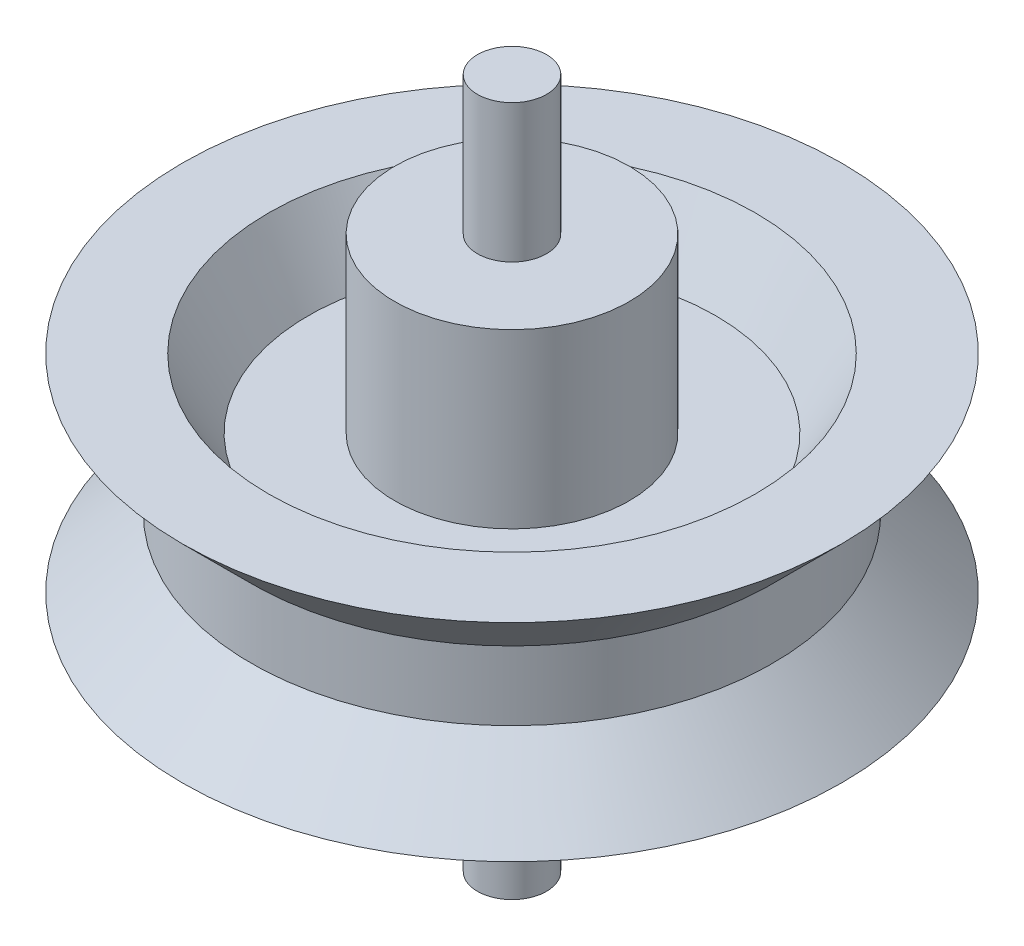
ISO-10303-21;
HEADER;
FILE_DESCRIPTION(('STEP AP214'),'2;1');
FILE_NAME('part.step','',(''),(''),'','','');
FILE_SCHEMA(('AUTOMOTIVE_DESIGN { 1 0 10303 214 1 1 1 1 }'));
ENDSEC;
DATA;
#1=APPLICATION_CONTEXT('core data for automotive mechanical design processes');
#2=APPLICATION_PROTOCOL_DEFINITION('international standard','automotive_design',2000,#1);
#3=PRODUCT_CONTEXT('',#1,'mechanical');
#4=PRODUCT('Part','Part','',(#3));
#5=PRODUCT_RELATED_PRODUCT_CATEGORY('part','',(#4));
#6=PRODUCT_DEFINITION_FORMATION('','',#4);
#7=PRODUCT_DEFINITION_CONTEXT('part definition',#1,'design');
#8=PRODUCT_DEFINITION('design','',#6,#7);
#9=PRODUCT_DEFINITION_SHAPE('','',#8);
#10=(LENGTH_UNIT() NAMED_UNIT(*) SI_UNIT(.MILLI.,.METRE.));
#11=(NAMED_UNIT(*) PLANE_ANGLE_UNIT() SI_UNIT($,.RADIAN.));
#12=(NAMED_UNIT(*) SI_UNIT($,.STERADIAN.) SOLID_ANGLE_UNIT());
#13=UNCERTAINTY_MEASURE_WITH_UNIT(LENGTH_MEASURE(1.E-05),#10,'distance_accuracy_value','');
#14=(GEOMETRIC_REPRESENTATION_CONTEXT(3) GLOBAL_UNCERTAINTY_ASSIGNED_CONTEXT((#13)) GLOBAL_UNIT_ASSIGNED_CONTEXT((#10,
#11,#12)) REPRESENTATION_CONTEXT('',''));
#15=CARTESIAN_POINT('',(0.,0.,0.));
#16=DIRECTION('',(0.,0.,1.));
#17=DIRECTION('',(1.,0.,0.));
#18=AXIS2_PLACEMENT_3D('',#15,#16,#17);
#19=CARTESIAN_POINT('',(0.,-4.99999999999997,-1.));
#20=DIRECTION('',(0.,-1.,0.));
#21=DIRECTION('',(0.,0.,-1.));
#22=AXIS2_PLACEMENT_3D('',#19,#20,#21);
#23=PLANE('',#22);
#24=CARTESIAN_POINT('',(0.,-4.99999999999997,0.));
#25=DIRECTION('',(0.,-1.,0.));
#26=DIRECTION('',(0.,0.,-1.));
#27=AXIS2_PLACEMENT_3D('',#24,#25,#26);
#28=CIRCLE('',#27,3.4);
#29=CARTESIAN_POINT('',(0.,-4.99999999999997,-3.4));
#30=VERTEX_POINT('',#29);
#31=EDGE_CURVE('E10',#30,#30,#28,.T.);
#32=ORIENTED_EDGE('',*,*,#31,.T.);
#33=EDGE_LOOP('',(#32));
#34=FACE_BOUND('',#33,.T.);
#35=CARTESIAN_POINT('',(0.,-4.99999999999997,0.));
#36=DIRECTION('',(0.,-1.,0.));
#37=DIRECTION('',(0.,0.,-1.));
#38=AXIS2_PLACEMENT_3D('',#35,#36,#37);
#39=CIRCLE('',#38,1.);
#40=CARTESIAN_POINT('',(0.,-4.99999999999997,-1.));
#41=VERTEX_POINT('',#40);
#42=EDGE_CURVE('E83',#41,#41,#39,.T.);
#43=ORIENTED_EDGE('',*,*,#42,.F.);
#44=EDGE_LOOP('',(#43));
#45=FACE_BOUND('',#44,.T.);
#46=ADVANCED_FACE('F31',(#34,#45),#23,.T.);
#47=CARTESIAN_POINT('',(0.,0.,0.));
#48=DIRECTION('',(0.,-1.,0.));
#49=DIRECTION('',(0.,0.,-1.));
#50=AXIS2_PLACEMENT_3D('',#47,#48,#49);
#51=CYLINDRICAL_SURFACE('',#50,3.4);
#52=CARTESIAN_POINT('',(0.,0.,0.));
#53=DIRECTION('',(0.,-1.,0.));
#54=DIRECTION('',(0.,0.,-1.));
#55=AXIS2_PLACEMENT_3D('',#52,#53,#54);
#56=CIRCLE('',#55,3.4);
#57=CARTESIAN_POINT('',(0.,0.,-3.4));
#58=VERTEX_POINT('',#57);
#59=EDGE_CURVE('E37',#58,#58,#56,.T.);
#60=ORIENTED_EDGE('',*,*,#59,.T.);
#61=EDGE_LOOP('',(#60));
#62=FACE_BOUND('',#61,.T.);
#63=ORIENTED_EDGE('',*,*,#31,.F.);
#64=EDGE_LOOP('',(#63));
#65=FACE_BOUND('',#64,.T.);
#66=ADVANCED_FACE('F91',(#62,#65),#51,.T.);
#67=CARTESIAN_POINT('',(0.,0.,-3.4));
#68=DIRECTION('',(0.,-1.,0.));
#69=DIRECTION('',(0.,0.,-1.));
#70=AXIS2_PLACEMENT_3D('',#67,#68,#69);
#71=PLANE('',#70);
#72=CARTESIAN_POINT('',(0.,0.,0.));
#73=DIRECTION('',(0.,-1.,0.));
#74=DIRECTION('',(0.,0.,-1.));
#75=AXIS2_PLACEMENT_3D('',#72,#73,#74);
#76=CIRCLE('',#75,5.9);
#77=CARTESIAN_POINT('',(0.,0.,-5.9));
#78=VERTEX_POINT('',#77);
#79=EDGE_CURVE('E41',#78,#78,#76,.T.);
#80=ORIENTED_EDGE('',*,*,#79,.T.);
#81=EDGE_LOOP('',(#80));
#82=FACE_BOUND('',#81,.T.);
#83=ORIENTED_EDGE('',*,*,#59,.F.);
#84=EDGE_LOOP('',(#83));
#85=FACE_BOUND('',#84,.T.);
#86=ADVANCED_FACE('F95',(#82,#85),#71,.T.);
#87=CARTESIAN_POINT('',(0.,0.,0.));
#88=DIRECTION('',(0.,-1.,0.));
#89=DIRECTION('',(0.,0.,-1.));
#90=AXIS2_PLACEMENT_3D('',#87,#88,#89);
#91=CONICAL_SURFACE('',#90,5.9,0.523598775598238);
#92=CARTESIAN_POINT('',(0.,-1.99999999999996,0.));
#93=DIRECTION('',(0.,-1.,0.));
#94=DIRECTION('',(0.,0.,-1.));
#95=AXIS2_PLACEMENT_3D('',#92,#93,#94);
#96=CIRCLE('',#95,7.05470053837909);
#97=CARTESIAN_POINT('',(0.,-1.99999999999996,-7.05470053837909));
#98=VERTEX_POINT('',#97);
#99=EDGE_CURVE('E45',#98,#98,#96,.T.);
#100=ORIENTED_EDGE('',*,*,#99,.T.);
#101=EDGE_LOOP('',(#100));
#102=FACE_BOUND('',#101,.T.);
#103=ORIENTED_EDGE('',*,*,#79,.F.);
#104=EDGE_LOOP('',(#103));
#105=FACE_BOUND('',#104,.T.);
#106=ADVANCED_FACE('F99',(#102,#105),#91,.F.);
#107=CARTESIAN_POINT('',(0.,-1.99999999999996,-7.05470053837909));
#108=DIRECTION('',(0.,-1.,0.));
#109=DIRECTION('',(0.,0.,-1.));
#110=AXIS2_PLACEMENT_3D('',#107,#108,#109);
#111=PLANE('',#110);
#112=CARTESIAN_POINT('',(0.,-1.99999999999997,0.));
#113=DIRECTION('',(0.,-1.,0.));
#114=DIRECTION('',(0.,0.,-1.));
#115=AXIS2_PLACEMENT_3D('',#112,#113,#114);
#116=CIRCLE('',#115,9.55470053837924);
#117=CARTESIAN_POINT('',(0.,-1.99999999999997,-9.55470053837924));
#118=VERTEX_POINT('',#117);
#119=EDGE_CURVE('E50',#118,#118,#116,.T.);
#120=ORIENTED_EDGE('',*,*,#119,.T.);
#121=EDGE_LOOP('',(#120));
#122=FACE_BOUND('',#121,.T.);
#123=ORIENTED_EDGE('',*,*,#99,.F.);
#124=EDGE_LOOP('',(#123));
#125=FACE_BOUND('',#124,.T.);
#126=ADVANCED_FACE('F106',(#122,#125),#111,.T.);
#127=CARTESIAN_POINT('',(0.,-1.99999999999997,0.));
#128=DIRECTION('',(0.,-1.,0.));
#129=DIRECTION('',(0.,0.,-1.));
#130=AXIS2_PLACEMENT_3D('',#127,#128,#129);
#131=CONICAL_SURFACE('',#130,9.55470053837924,0.78539816339745);
#132=CARTESIAN_POINT('',(0.,0.,0.));
#133=DIRECTION('',(0.,-1.,0.));
#134=DIRECTION('',(0.,0.,-1.));
#135=AXIS2_PLACEMENT_3D('',#132,#133,#134);
#136=CIRCLE('',#135,7.55470053837923);
#137=CARTESIAN_POINT('',(0.,0.,-7.55470053837923));
#138=VERTEX_POINT('',#137);
#139=EDGE_CURVE('E53',#138,#138,#136,.T.);
#140=ORIENTED_EDGE('',*,*,#139,.T.);
#141=EDGE_LOOP('',(#140));
#142=FACE_BOUND('',#141,.T.);
#143=ORIENTED_EDGE('',*,*,#119,.F.);
#144=EDGE_LOOP('',(#143));
#145=FACE_BOUND('',#144,.T.);
#146=ADVANCED_FACE('F110',(#142,#145),#131,.T.);
#147=CARTESIAN_POINT('',(0.,0.,0.));
#148=DIRECTION('',(0.,-1.,0.));
#149=DIRECTION('',(0.,0.,-1.));
#150=AXIS2_PLACEMENT_3D('',#147,#148,#149);
#151=CYLINDRICAL_SURFACE('',#150,7.55470053837923);
#152=CARTESIAN_POINT('',(0.,2.00000000000003,0.));
#153=DIRECTION('',(0.,-1.,0.));
#154=DIRECTION('',(0.,0.,-1.));
#155=AXIS2_PLACEMENT_3D('',#152,#153,#154);
#156=CIRCLE('',#155,7.55470053837923);
#157=CARTESIAN_POINT('',(0.,2.00000000000003,-7.55470053837923));
#158=VERTEX_POINT('',#157);
#159=EDGE_CURVE('E56',#158,#158,#156,.T.);
#160=ORIENTED_EDGE('',*,*,#159,.T.);
#161=EDGE_LOOP('',(#160));
#162=FACE_BOUND('',#161,.T.);
#163=ORIENTED_EDGE('',*,*,#139,.F.);
#164=EDGE_LOOP('',(#163));
#165=FACE_BOUND('',#164,.T.);
#166=ADVANCED_FACE('F114',(#162,#165),#151,.T.);
#167=CARTESIAN_POINT('',(0.,2.00000000000003,0.));
#168=DIRECTION('',(0.,1.,0.));
#169=DIRECTION('',(0.,0.,1.));
#170=AXIS2_PLACEMENT_3D('',#167,#168,#169);
#171=CONICAL_SURFACE('',#170,7.55470053837923,0.785398163397415);
#172=CARTESIAN_POINT('',(0.,4.00000000000003,0.));
#173=DIRECTION('',(0.,-1.,0.));
#174=DIRECTION('',(0.,0.,-1.));
#175=AXIS2_PLACEMENT_3D('',#172,#173,#174);
#176=CIRCLE('',#175,9.5547005383791);
#177=CARTESIAN_POINT('',(0.,4.00000000000003,-9.5547005383791));
#178=VERTEX_POINT('',#177);
#179=EDGE_CURVE('E59',#178,#178,#176,.T.);
#180=ORIENTED_EDGE('',*,*,#179,.T.);
#181=EDGE_LOOP('',(#180));
#182=FACE_BOUND('',#181,.T.);
#183=ORIENTED_EDGE('',*,*,#159,.F.);
#184=EDGE_LOOP('',(#183));
#185=FACE_BOUND('',#184,.T.);
#186=ADVANCED_FACE('F118',(#182,#185),#171,.T.);
#187=CARTESIAN_POINT('',(0.,4.00000000000004,-9.5547005383791));
#188=DIRECTION('',(0.,1.,0.));
#189=DIRECTION('',(0.,0.,1.));
#190=AXIS2_PLACEMENT_3D('',#187,#188,#189);
#191=PLANE('',#190);
#192=CARTESIAN_POINT('',(0.,4.00000000000004,0.));
#193=DIRECTION('',(0.,-1.,0.));
#194=DIRECTION('',(0.,0.,-1.));
#195=AXIS2_PLACEMENT_3D('',#192,#193,#194);
#196=CIRCLE('',#195,7.05470053837908);
#197=CARTESIAN_POINT('',(0.,4.00000000000004,-7.05470053837908));
#198=VERTEX_POINT('',#197);
#199=EDGE_CURVE('E62',#198,#198,#196,.T.);
#200=ORIENTED_EDGE('',*,*,#199,.T.);
#201=EDGE_LOOP('',(#200));
#202=FACE_BOUND('',#201,.T.);
#203=ORIENTED_EDGE('',*,*,#179,.F.);
#204=EDGE_LOOP('',(#203));
#205=FACE_BOUND('',#204,.T.);
#206=ADVANCED_FACE('F122',(#202,#205),#191,.T.);
#207=CARTESIAN_POINT('',(0.,4.00000000000004,0.));
#208=DIRECTION('',(0.,1.,0.));
#209=DIRECTION('',(0.,0.,1.));
#210=AXIS2_PLACEMENT_3D('',#207,#208,#209);
#211=CONICAL_SURFACE('',#210,7.05470053837908,0.523598775598296);
#212=CARTESIAN_POINT('',(0.,2.00000000000004,0.));
#213=DIRECTION('',(0.,-1.,0.));
#214=DIRECTION('',(0.,0.,-1.));
#215=AXIS2_PLACEMENT_3D('',#212,#213,#214);
#216=CIRCLE('',#215,5.89999999999984);
#217=CARTESIAN_POINT('',(0.,2.00000000000004,-5.89999999999984));
#218=VERTEX_POINT('',#217);
#219=EDGE_CURVE('E65',#218,#218,#216,.T.);
#220=ORIENTED_EDGE('',*,*,#219,.T.);
#221=EDGE_LOOP('',(#220));
#222=FACE_BOUND('',#221,.T.);
#223=ORIENTED_EDGE('',*,*,#199,.F.);
#224=EDGE_LOOP('',(#223));
#225=FACE_BOUND('',#224,.T.);
#226=ADVANCED_FACE('F126',(#222,#225),#211,.F.);
#227=CARTESIAN_POINT('',(0.,2.00000000000003,-5.89999999999984));
#228=DIRECTION('',(0.,1.,0.));
#229=DIRECTION('',(0.,0.,1.));
#230=AXIS2_PLACEMENT_3D('',#227,#228,#229);
#231=PLANE('',#230);
#232=CARTESIAN_POINT('',(0.,2.00000000000003,0.));
#233=DIRECTION('',(0.,-1.,0.));
#234=DIRECTION('',(0.,0.,-1.));
#235=AXIS2_PLACEMENT_3D('',#232,#233,#234);
#236=CIRCLE('',#235,3.4);
#237=CARTESIAN_POINT('',(0.,2.00000000000003,-3.4));
#238=VERTEX_POINT('',#237);
#239=EDGE_CURVE('E68',#238,#238,#236,.T.);
#240=ORIENTED_EDGE('',*,*,#239,.T.);
#241=EDGE_LOOP('',(#240));
#242=FACE_BOUND('',#241,.T.);
#243=ORIENTED_EDGE('',*,*,#219,.F.);
#244=EDGE_LOOP('',(#243));
#245=FACE_BOUND('',#244,.T.);
#246=ADVANCED_FACE('F130',(#242,#245),#231,.T.);
#247=CARTESIAN_POINT('',(0.,0.,0.));
#248=DIRECTION('',(0.,-1.,0.));
#249=DIRECTION('',(0.,0.,-1.));
#250=AXIS2_PLACEMENT_3D('',#247,#248,#249);
#251=CYLINDRICAL_SURFACE('',#250,3.4);
#252=CARTESIAN_POINT('',(0.,7.00000000000003,0.));
#253=DIRECTION('',(0.,-1.,0.));
#254=DIRECTION('',(0.,0.,-1.));
#255=AXIS2_PLACEMENT_3D('',#252,#253,#254);
#256=CIRCLE('',#255,3.4);
#257=CARTESIAN_POINT('',(0.,7.00000000000003,-3.4));
#258=VERTEX_POINT('',#257);
#259=EDGE_CURVE('E71',#258,#258,#256,.T.);
#260=ORIENTED_EDGE('',*,*,#259,.T.);
#261=EDGE_LOOP('',(#260));
#262=FACE_BOUND('',#261,.T.);
#263=ORIENTED_EDGE('',*,*,#239,.F.);
#264=EDGE_LOOP('',(#263));
#265=FACE_BOUND('',#264,.T.);
#266=ADVANCED_FACE('F134',(#262,#265),#251,.T.);
#267=CARTESIAN_POINT('',(0.,7.00000000000003,-3.4));
#268=DIRECTION('',(0.,1.,0.));
#269=DIRECTION('',(0.,0.,1.));
#270=AXIS2_PLACEMENT_3D('',#267,#268,#269);
#271=PLANE('',#270);
#272=CARTESIAN_POINT('',(0.,7.00000000000003,0.));
#273=DIRECTION('',(0.,-1.,0.));
#274=DIRECTION('',(0.,0.,-1.));
#275=AXIS2_PLACEMENT_3D('',#272,#273,#274);
#276=CIRCLE('',#275,1.);
#277=CARTESIAN_POINT('',(0.,7.00000000000003,-1.));
#278=VERTEX_POINT('',#277);
#279=EDGE_CURVE('E74',#278,#278,#276,.T.);
#280=ORIENTED_EDGE('',*,*,#279,.T.);
#281=EDGE_LOOP('',(#280));
#282=FACE_BOUND('',#281,.T.);
#283=ORIENTED_EDGE('',*,*,#259,.F.);
#284=EDGE_LOOP('',(#283));
#285=FACE_BOUND('',#284,.T.);
#286=ADVANCED_FACE('F138',(#282,#285),#271,.T.);
#287=CARTESIAN_POINT('',(0.,0.,0.));
#288=DIRECTION('',(0.,-1.,0.));
#289=DIRECTION('',(0.,0.,-1.));
#290=AXIS2_PLACEMENT_3D('',#287,#288,#289);
#291=CYLINDRICAL_SURFACE('',#290,1.);
#292=CARTESIAN_POINT('',(0.,11.,0.));
#293=DIRECTION('',(0.,-1.,0.));
#294=DIRECTION('',(0.,0.,-1.));
#295=AXIS2_PLACEMENT_3D('',#292,#293,#294);
#296=CIRCLE('',#295,1.);
#297=CARTESIAN_POINT('',(0.,11.,-1.));
#298=VERTEX_POINT('',#297);
#299=EDGE_CURVE('E77',#298,#298,#296,.T.);
#300=ORIENTED_EDGE('',*,*,#299,.T.);
#301=EDGE_LOOP('',(#300));
#302=FACE_BOUND('',#301,.T.);
#303=ORIENTED_EDGE('',*,*,#279,.F.);
#304=EDGE_LOOP('',(#303));
#305=FACE_BOUND('',#304,.T.);
#306=ADVANCED_FACE('F142',(#302,#305),#291,.T.);
#307=CARTESIAN_POINT('',(0.,11.,-1.));
#308=DIRECTION('',(0.,1.,0.));
#309=DIRECTION('',(0.,0.,1.));
#310=AXIS2_PLACEMENT_3D('',#307,#308,#309);
#311=PLANE('',#310);
#312=ORIENTED_EDGE('',*,*,#299,.F.);
#313=EDGE_LOOP('',(#312));
#314=FACE_BOUND('',#313,.T.);
#315=ADVANCED_FACE('F146',(#314),#311,.T.);
#316=CARTESIAN_POINT('',(0.,-9.,0.));
#317=DIRECTION('',(0.,-1.,0.));
#318=DIRECTION('',(0.,0.,-1.));
#319=AXIS2_PLACEMENT_3D('',#316,#317,#318);
#320=PLANE('',#319);
#321=CARTESIAN_POINT('',(0.,-9.,0.));
#322=DIRECTION('',(0.,-1.,0.));
#323=DIRECTION('',(0.,0.,-1.));
#324=AXIS2_PLACEMENT_3D('',#321,#322,#323);
#325=CIRCLE('',#324,1.);
#326=CARTESIAN_POINT('',(0.,-9.,-1.));
#327=VERTEX_POINT('',#326);
#328=EDGE_CURVE('E80',#327,#327,#325,.T.);
#329=ORIENTED_EDGE('',*,*,#328,.T.);
#330=EDGE_LOOP('',(#329));
#331=FACE_BOUND('',#330,.T.);
#332=ADVANCED_FACE('F150',(#331),#320,.T.);
#333=CARTESIAN_POINT('',(0.,0.,0.));
#334=DIRECTION('',(0.,-1.,0.));
#335=DIRECTION('',(0.,0.,-1.));
#336=AXIS2_PLACEMENT_3D('',#333,#334,#335);
#337=CYLINDRICAL_SURFACE('',#336,1.);
#338=ORIENTED_EDGE('',*,*,#42,.T.);
#339=EDGE_LOOP('',(#338));
#340=FACE_BOUND('',#339,.T.);
#341=ORIENTED_EDGE('',*,*,#328,.F.);
#342=EDGE_LOOP('',(#341));
#343=FACE_BOUND('',#342,.T.);
#344=ADVANCED_FACE('F87',(#340,#343),#337,.T.);
#345=CLOSED_SHELL('',(#46,#66,#86,#106,#126,#146,#166,#186,#206,#226,#246,#266,#286,#306,#315,
#332,#344));
#346=MANIFOLD_SOLID_BREP('B2',#345);
#347=ADVANCED_BREP_SHAPE_REPRESENTATION('',(#18,#346),#14);
#348=SHAPE_DEFINITION_REPRESENTATION(#9,#347);
ENDSEC;
END-ISO-10303-21;
